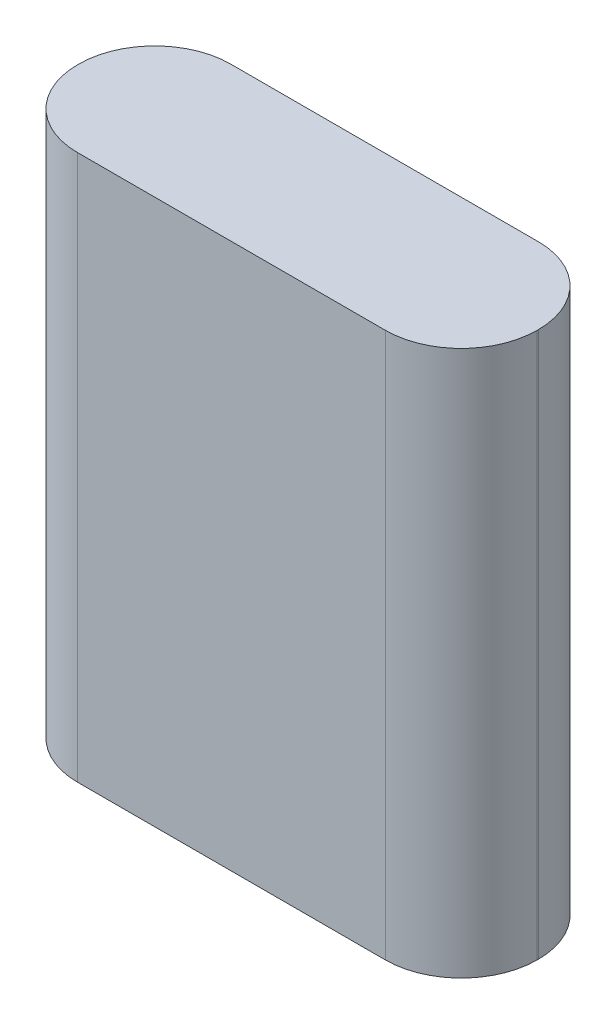
ISO-10303-21;
HEADER;
FILE_DESCRIPTION(('STEP AP214'),'2;1');
FILE_NAME('part.step','',(''),(''),'','','');
FILE_SCHEMA(('AUTOMOTIVE_DESIGN { 1 0 10303 214 1 1 1 1 }'));
ENDSEC;
DATA;
#1=APPLICATION_CONTEXT('core data for automotive mechanical design processes');
#2=APPLICATION_PROTOCOL_DEFINITION('international standard','automotive_design',2000,#1);
#3=PRODUCT_CONTEXT('',#1,'mechanical');
#4=PRODUCT('Part','Part','',(#3));
#5=PRODUCT_RELATED_PRODUCT_CATEGORY('part','',(#4));
#6=PRODUCT_DEFINITION_FORMATION('','',#4);
#7=PRODUCT_DEFINITION_CONTEXT('part definition',#1,'design');
#8=PRODUCT_DEFINITION('design','',#6,#7);
#9=PRODUCT_DEFINITION_SHAPE('','',#8);
#10=(LENGTH_UNIT() NAMED_UNIT(*) SI_UNIT(.MILLI.,.METRE.));
#11=(NAMED_UNIT(*) PLANE_ANGLE_UNIT() SI_UNIT($,.RADIAN.));
#12=(NAMED_UNIT(*) SI_UNIT($,.STERADIAN.) SOLID_ANGLE_UNIT());
#13=UNCERTAINTY_MEASURE_WITH_UNIT(LENGTH_MEASURE(1.E-05),#10,'distance_accuracy_value','');
#14=(GEOMETRIC_REPRESENTATION_CONTEXT(3) GLOBAL_UNCERTAINTY_ASSIGNED_CONTEXT((#13)) GLOBAL_UNIT_ASSIGNED_CONTEXT((#10,
#11,#12)) REPRESENTATION_CONTEXT('',''));
#15=CARTESIAN_POINT('',(0.,0.,0.));
#16=DIRECTION('',(0.,0.,1.));
#17=DIRECTION('',(1.,0.,0.));
#18=AXIS2_PLACEMENT_3D('',#15,#16,#17);
#19=CARTESIAN_POINT('',(21.5,51.,-7.16500000000001));
#20=DIRECTION('',(-1.,0.,0.));
#21=DIRECTION('',(0.,0.,1.));
#22=AXIS2_PLACEMENT_3D('',#19,#20,#21);
#23=PLANE('',#22);
#24=DIRECTION('',(0.,0.,-1.));
#25=VECTOR('',#24,1.);
#26=CARTESIAN_POINT('',(21.5,0.,-7.16500000000001));
#27=LINE('',#26,#25);
#28=CARTESIAN_POINT('',(21.5,0.,0.0649999999999956));
#29=VERTEX_POINT('',#28);
#30=CARTESIAN_POINT('',(21.5,0.,-0.065000000000006));
#31=VERTEX_POINT('',#30);
#32=EDGE_CURVE('E137',#29,#31,#27,.T.);
#33=ORIENTED_EDGE('',*,*,#32,.T.);
#34=DIRECTION('',(0.,-1.,0.));
#35=VECTOR('',#34,1.);
#36=CARTESIAN_POINT('',(21.5,51.,-0.065000000000006));
#37=LINE('',#36,#35);
#38=CARTESIAN_POINT('',(21.5,51.,-0.065000000000006));
#39=VERTEX_POINT('',#38);
#40=EDGE_CURVE('E111',#31,#39,#37,.F.);
#41=ORIENTED_EDGE('',*,*,#40,.T.);
#42=DIRECTION('',(0.,0.,-1.));
#43=VECTOR('',#42,1.);
#44=CARTESIAN_POINT('',(21.5,51.,-7.16500000000001));
#45=LINE('',#44,#43);
#46=CARTESIAN_POINT('',(21.5,51.,0.0649999999999956));
#47=VERTEX_POINT('',#46);
#48=EDGE_CURVE('E149',#47,#39,#45,.T.);
#49=ORIENTED_EDGE('',*,*,#48,.F.);
#50=DIRECTION('',(0.,-1.,0.));
#51=VECTOR('',#50,1.);
#52=CARTESIAN_POINT('',(21.5,51.,0.0649999999999956));
#53=LINE('',#52,#51);
#54=EDGE_CURVE('E117',#47,#29,#53,.T.);
#55=ORIENTED_EDGE('',*,*,#54,.T.);
#56=EDGE_LOOP('',(#33,#41,#49,#55));
#57=FACE_BOUND('',#56,.T.);
#58=ADVANCED_FACE('F38',(#57),#23,.F.);
#59=CARTESIAN_POINT('',(-21.5,51.,-7.16500000000001));
#60=DIRECTION('',(0.,0.,1.));
#61=DIRECTION('',(1.,0.,0.));
#62=AXIS2_PLACEMENT_3D('',#59,#60,#61);
#63=PLANE('',#62);
#64=DIRECTION('',(-1.,0.,0.));
#65=VECTOR('',#64,1.);
#66=CARTESIAN_POINT('',(-21.5,51.,-7.16500000000001));
#67=LINE('',#66,#65);
#68=CARTESIAN_POINT('',(14.4,51.,-7.16500000000001));
#69=VERTEX_POINT('',#68);
#70=CARTESIAN_POINT('',(-14.4,51.,-7.16500000000001));
#71=VERTEX_POINT('',#70);
#72=EDGE_CURVE('E127',#69,#71,#67,.T.);
#73=ORIENTED_EDGE('',*,*,#72,.F.);
#74=DIRECTION('',(0.,-1.,0.));
#75=VECTOR('',#74,1.);
#76=CARTESIAN_POINT('',(14.4,51.,-7.16500000000001));
#77=LINE('',#76,#75);
#78=CARTESIAN_POINT('',(14.4,0.,-7.16500000000001));
#79=VERTEX_POINT('',#78);
#80=EDGE_CURVE('E110',#69,#79,#77,.T.);
#81=ORIENTED_EDGE('',*,*,#80,.T.);
#82=DIRECTION('',(-1.,0.,0.));
#83=VECTOR('',#82,1.);
#84=CARTESIAN_POINT('',(-21.5,0.,-7.16500000000001));
#85=LINE('',#84,#83);
#86=CARTESIAN_POINT('',(-14.4,0.,-7.16500000000001));
#87=VERTEX_POINT('',#86);
#88=EDGE_CURVE('E124',#79,#87,#85,.T.);
#89=ORIENTED_EDGE('',*,*,#88,.T.);
#90=DIRECTION('',(0.,-1.,0.));
#91=VECTOR('',#90,1.);
#92=CARTESIAN_POINT('',(-14.4,51.,-7.16500000000001));
#93=LINE('',#92,#91);
#94=EDGE_CURVE('E130',#87,#71,#93,.F.);
#95=ORIENTED_EDGE('',*,*,#94,.T.);
#96=EDGE_LOOP('',(#73,#81,#89,#95));
#97=FACE_BOUND('',#96,.T.);
#98=ADVANCED_FACE('F123',(#97),#63,.F.);
#99=CARTESIAN_POINT('',(-21.5,51.,-7.16500000000001));
#100=DIRECTION('',(1.,0.,0.));
#101=DIRECTION('',(0.,0.,-1.));
#102=AXIS2_PLACEMENT_3D('',#99,#100,#101);
#103=PLANE('',#102);
#104=DIRECTION('',(0.,0.,1.));
#105=VECTOR('',#104,1.);
#106=CARTESIAN_POINT('',(-21.5,51.,-7.16500000000001));
#107=LINE('',#106,#105);
#108=CARTESIAN_POINT('',(-21.5,51.,-0.0650000000000026));
#109=VERTEX_POINT('',#108);
#110=CARTESIAN_POINT('',(-21.5,51.,0.0649999999999991));
#111=VERTEX_POINT('',#110);
#112=EDGE_CURVE('E185',#109,#111,#107,.T.);
#113=ORIENTED_EDGE('',*,*,#112,.F.);
#114=DIRECTION('',(0.,-1.,0.));
#115=VECTOR('',#114,1.);
#116=CARTESIAN_POINT('',(-21.5,51.,-0.0650000000000026));
#117=LINE('',#116,#115);
#118=CARTESIAN_POINT('',(-21.5,0.,-0.0650000000000026));
#119=VERTEX_POINT('',#118);
#120=EDGE_CURVE('E11',#109,#119,#117,.T.);
#121=ORIENTED_EDGE('',*,*,#120,.T.);
#122=DIRECTION('',(0.,0.,1.));
#123=VECTOR('',#122,1.);
#124=CARTESIAN_POINT('',(-21.5,0.,-7.16500000000001));
#125=LINE('',#124,#123);
#126=CARTESIAN_POINT('',(-21.5,0.,0.0649999999999991));
#127=VERTEX_POINT('',#126);
#128=EDGE_CURVE('E136',#119,#127,#125,.T.);
#129=ORIENTED_EDGE('',*,*,#128,.T.);
#130=DIRECTION('',(0.,-1.,0.));
#131=VECTOR('',#130,1.);
#132=CARTESIAN_POINT('',(-21.5,51.,0.0649999999999991));
#133=LINE('',#132,#131);
#134=EDGE_CURVE('E47',#127,#111,#133,.F.);
#135=ORIENTED_EDGE('',*,*,#134,.T.);
#136=EDGE_LOOP('',(#113,#121,#129,#135));
#137=FACE_BOUND('',#136,.T.);
#138=ADVANCED_FACE('F184',(#137),#103,.F.);
#139=CARTESIAN_POINT('',(-21.5,51.,7.165));
#140=DIRECTION('',(0.,0.,-1.));
#141=DIRECTION('',(-1.,0.,0.));
#142=AXIS2_PLACEMENT_3D('',#139,#140,#141);
#143=PLANE('',#142);
#144=DIRECTION('',(1.,0.,0.));
#145=VECTOR('',#144,1.);
#146=CARTESIAN_POINT('',(-21.5,0.,7.165));
#147=LINE('',#146,#145);
#148=CARTESIAN_POINT('',(-14.4,0.,7.165));
#149=VERTEX_POINT('',#148);
#150=CARTESIAN_POINT('',(14.4,0.,7.165));
#151=VERTEX_POINT('',#150);
#152=EDGE_CURVE('E142',#149,#151,#147,.T.);
#153=ORIENTED_EDGE('',*,*,#152,.T.);
#154=DIRECTION('',(0.,-1.,0.));
#155=VECTOR('',#154,1.);
#156=CARTESIAN_POINT('',(14.4,51.,7.165));
#157=LINE('',#156,#155);
#158=CARTESIAN_POINT('',(14.4,51.,7.165));
#159=VERTEX_POINT('',#158);
#160=EDGE_CURVE('E54',#151,#159,#157,.F.);
#161=ORIENTED_EDGE('',*,*,#160,.T.);
#162=DIRECTION('',(1.,0.,0.));
#163=VECTOR('',#162,1.);
#164=CARTESIAN_POINT('',(-21.5,51.,7.165));
#165=LINE('',#164,#163);
#166=CARTESIAN_POINT('',(-14.4,51.,7.165));
#167=VERTEX_POINT('',#166);
#168=EDGE_CURVE('E151',#167,#159,#165,.T.);
#169=ORIENTED_EDGE('',*,*,#168,.F.);
#170=DIRECTION('',(0.,-1.,0.));
#171=VECTOR('',#170,1.);
#172=CARTESIAN_POINT('',(-14.4,51.,7.165));
#173=LINE('',#172,#171);
#174=EDGE_CURVE('E175',#167,#149,#173,.T.);
#175=ORIENTED_EDGE('',*,*,#174,.T.);
#176=EDGE_LOOP('',(#153,#161,#169,#175));
#177=FACE_BOUND('',#176,.T.);
#178=ADVANCED_FACE('F195',(#177),#143,.F.);
#179=CARTESIAN_POINT('',(0.,51.,0.));
#180=DIRECTION('',(0.,1.,0.));
#181=DIRECTION('',(0.,0.,1.));
#182=AXIS2_PLACEMENT_3D('',#179,#180,#181);
#183=PLANE('',#182);
#184=ORIENTED_EDGE('',*,*,#48,.T.);
#185=CARTESIAN_POINT('',(14.4,51.,-0.065000000000006));
#186=DIRECTION('',(0.,1.,0.));
#187=DIRECTION('',(0.,0.,1.));
#188=AXIS2_PLACEMENT_3D('',#185,#186,#187);
#189=CIRCLE('',#188,7.1);
#190=EDGE_CURVE('E172',#39,#69,#189,.T.);
#191=ORIENTED_EDGE('',*,*,#190,.T.);
#192=ORIENTED_EDGE('',*,*,#72,.T.);
#193=CARTESIAN_POINT('',(-14.4,51.,-0.065000000000006));
#194=DIRECTION('',(0.,1.,0.));
#195=DIRECTION('',(0.,0.,1.));
#196=AXIS2_PLACEMENT_3D('',#193,#194,#195);
#197=CIRCLE('',#196,7.1);
#198=EDGE_CURVE('E166',#71,#109,#197,.T.);
#199=ORIENTED_EDGE('',*,*,#198,.T.);
#200=ORIENTED_EDGE('',*,*,#112,.T.);
#201=CARTESIAN_POINT('',(-14.4,51.,0.0649999999999956));
#202=DIRECTION('',(0.,1.,0.));
#203=DIRECTION('',(0.,0.,1.));
#204=AXIS2_PLACEMENT_3D('',#201,#202,#203);
#205=CIRCLE('',#204,7.1);
#206=EDGE_CURVE('E61',#111,#167,#205,.T.);
#207=ORIENTED_EDGE('',*,*,#206,.T.);
#208=ORIENTED_EDGE('',*,*,#168,.T.);
#209=CARTESIAN_POINT('',(14.4,51.,0.0649999999999956));
#210=DIRECTION('',(0.,1.,0.));
#211=DIRECTION('',(0.,0.,1.));
#212=AXIS2_PLACEMENT_3D('',#209,#210,#211);
#213=CIRCLE('',#212,7.1);
#214=EDGE_CURVE('E169',#159,#47,#213,.T.);
#215=ORIENTED_EDGE('',*,*,#214,.T.);
#216=EDGE_LOOP('',(#184,#191,#192,#199,#200,#207,#208,#215));
#217=FACE_BOUND('',#216,.T.);
#218=ADVANCED_FACE('F189',(#217),#183,.T.);
#219=CARTESIAN_POINT('',(0.,0.,0.));
#220=DIRECTION('',(0.,1.,0.));
#221=DIRECTION('',(0.,0.,1.));
#222=AXIS2_PLACEMENT_3D('',#219,#220,#221);
#223=PLANE('',#222);
#224=ORIENTED_EDGE('',*,*,#88,.F.);
#225=CARTESIAN_POINT('',(14.4,0.,-0.065000000000006));
#226=DIRECTION('',(0.,1.,0.));
#227=DIRECTION('',(0.,0.,1.));
#228=AXIS2_PLACEMENT_3D('',#225,#226,#227);
#229=CIRCLE('',#228,7.1);
#230=EDGE_CURVE('E106',#79,#31,#229,.F.);
#231=ORIENTED_EDGE('',*,*,#230,.T.);
#232=ORIENTED_EDGE('',*,*,#32,.F.);
#233=CARTESIAN_POINT('',(14.4,0.,0.0649999999999956));
#234=DIRECTION('',(0.,1.,0.));
#235=DIRECTION('',(0.,0.,1.));
#236=AXIS2_PLACEMENT_3D('',#233,#234,#235);
#237=CIRCLE('',#236,7.1);
#238=EDGE_CURVE('E118',#29,#151,#237,.F.);
#239=ORIENTED_EDGE('',*,*,#238,.T.);
#240=ORIENTED_EDGE('',*,*,#152,.F.);
#241=CARTESIAN_POINT('',(-14.4,0.,0.0649999999999956));
#242=DIRECTION('',(0.,1.,0.));
#243=DIRECTION('',(0.,0.,1.));
#244=AXIS2_PLACEMENT_3D('',#241,#242,#243);
#245=CIRCLE('',#244,7.1);
#246=EDGE_CURVE('E129',#149,#127,#245,.F.);
#247=ORIENTED_EDGE('',*,*,#246,.T.);
#248=ORIENTED_EDGE('',*,*,#128,.F.);
#249=CARTESIAN_POINT('',(-14.4,0.,-0.065000000000006));
#250=DIRECTION('',(0.,1.,0.));
#251=DIRECTION('',(0.,0.,1.));
#252=AXIS2_PLACEMENT_3D('',#249,#250,#251);
#253=CIRCLE('',#252,7.1);
#254=EDGE_CURVE('E134',#119,#87,#253,.F.);
#255=ORIENTED_EDGE('',*,*,#254,.T.);
#256=EDGE_LOOP('',(#224,#231,#232,#239,#240,#247,#248,#255));
#257=FACE_BOUND('',#256,.T.);
#258=ADVANCED_FACE('F132',(#257),#223,.F.);
#259=CARTESIAN_POINT('',(14.4,51.,-0.065000000000006));
#260=DIRECTION('',(0.,-1.,0.));
#261=DIRECTION('',(0.,0.,-1.));
#262=AXIS2_PLACEMENT_3D('',#259,#260,#261);
#263=CYLINDRICAL_SURFACE('',#262,7.1);
#264=ORIENTED_EDGE('',*,*,#190,.F.);
#265=ORIENTED_EDGE('',*,*,#40,.F.);
#266=ORIENTED_EDGE('',*,*,#230,.F.);
#267=ORIENTED_EDGE('',*,*,#80,.F.);
#268=EDGE_LOOP('',(#264,#265,#266,#267));
#269=FACE_BOUND('',#268,.T.);
#270=ADVANCED_FACE('F109',(#269),#263,.T.);
#271=CARTESIAN_POINT('',(14.4,51.,0.0649999999999956));
#272=DIRECTION('',(0.,-1.,0.));
#273=DIRECTION('',(0.,0.,-1.));
#274=AXIS2_PLACEMENT_3D('',#271,#272,#273);
#275=CYLINDRICAL_SURFACE('',#274,7.1);
#276=ORIENTED_EDGE('',*,*,#214,.F.);
#277=ORIENTED_EDGE('',*,*,#160,.F.);
#278=ORIENTED_EDGE('',*,*,#238,.F.);
#279=ORIENTED_EDGE('',*,*,#54,.F.);
#280=EDGE_LOOP('',(#276,#277,#278,#279));
#281=FACE_BOUND('',#280,.T.);
#282=ADVANCED_FACE('F199',(#281),#275,.T.);
#283=CARTESIAN_POINT('',(-14.4,51.,-0.065000000000006));
#284=DIRECTION('',(0.,-1.,0.));
#285=DIRECTION('',(0.,0.,-1.));
#286=AXIS2_PLACEMENT_3D('',#283,#284,#285);
#287=CYLINDRICAL_SURFACE('',#286,7.1);
#288=ORIENTED_EDGE('',*,*,#198,.F.);
#289=ORIENTED_EDGE('',*,*,#94,.F.);
#290=ORIENTED_EDGE('',*,*,#254,.F.);
#291=ORIENTED_EDGE('',*,*,#120,.F.);
#292=EDGE_LOOP('',(#288,#289,#290,#291));
#293=FACE_BOUND('',#292,.T.);
#294=ADVANCED_FACE('F208',(#293),#287,.T.);
#295=CARTESIAN_POINT('',(-14.4,51.,0.0649999999999956));
#296=DIRECTION('',(0.,-1.,0.));
#297=DIRECTION('',(0.,0.,-1.));
#298=AXIS2_PLACEMENT_3D('',#295,#296,#297);
#299=CYLINDRICAL_SURFACE('',#298,7.1);
#300=ORIENTED_EDGE('',*,*,#206,.F.);
#301=ORIENTED_EDGE('',*,*,#134,.F.);
#302=ORIENTED_EDGE('',*,*,#246,.F.);
#303=ORIENTED_EDGE('',*,*,#174,.F.);
#304=EDGE_LOOP('',(#300,#301,#302,#303));
#305=FACE_BOUND('',#304,.T.);
#306=ADVANCED_FACE('F40',(#305),#299,.T.);
#307=CLOSED_SHELL('',(#58,#98,#138,#178,#218,#258,#270,#282,#294,#306));
#308=MANIFOLD_SOLID_BREP('B2',#307);
#309=ADVANCED_BREP_SHAPE_REPRESENTATION('',(#18,#308),#14);
#310=SHAPE_DEFINITION_REPRESENTATION(#9,#309);
ENDSEC;
END-ISO-10303-21;
